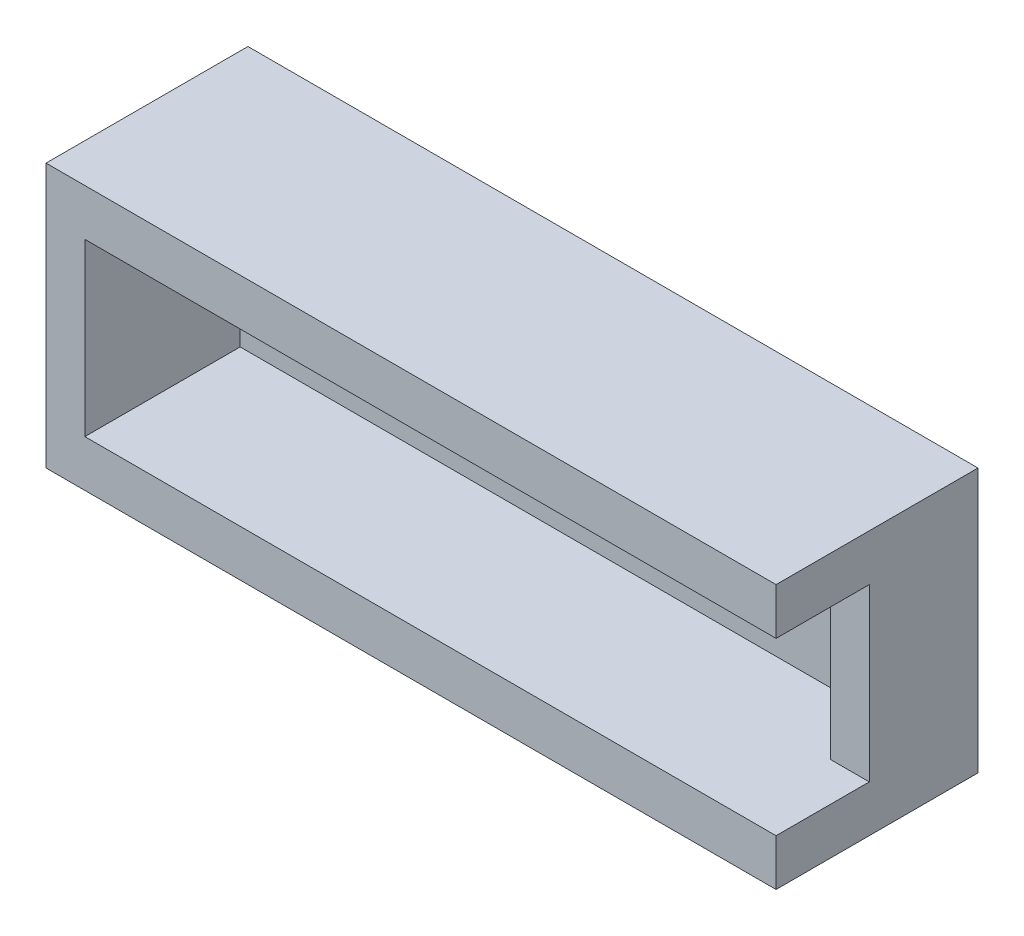
ISO-10303-21;
HEADER;
FILE_DESCRIPTION(('STEP AP214'),'2;1');
FILE_NAME('part.step','',(''),(''),'','','');
FILE_SCHEMA(('AUTOMOTIVE_DESIGN { 1 0 10303 214 1 1 1 1 }'));
ENDSEC;
DATA;
#1=APPLICATION_CONTEXT('core data for automotive mechanical design processes');
#2=APPLICATION_PROTOCOL_DEFINITION('international standard','automotive_design',2000,#1);
#3=PRODUCT_CONTEXT('',#1,'mechanical');
#4=PRODUCT('Part','Part','',(#3));
#5=PRODUCT_RELATED_PRODUCT_CATEGORY('part','',(#4));
#6=PRODUCT_DEFINITION_FORMATION('','',#4);
#7=PRODUCT_DEFINITION_CONTEXT('part definition',#1,'design');
#8=PRODUCT_DEFINITION('design','',#6,#7);
#9=PRODUCT_DEFINITION_SHAPE('','',#8);
#10=(LENGTH_UNIT() NAMED_UNIT(*) SI_UNIT(.MILLI.,.METRE.));
#11=(NAMED_UNIT(*) PLANE_ANGLE_UNIT() SI_UNIT($,.RADIAN.));
#12=(NAMED_UNIT(*) SI_UNIT($,.STERADIAN.) SOLID_ANGLE_UNIT());
#13=UNCERTAINTY_MEASURE_WITH_UNIT(LENGTH_MEASURE(1.E-05),#10,'distance_accuracy_value','');
#14=(GEOMETRIC_REPRESENTATION_CONTEXT(3) GLOBAL_UNCERTAINTY_ASSIGNED_CONTEXT((#13)) GLOBAL_UNIT_ASSIGNED_CONTEXT((#10,
#11,#12)) REPRESENTATION_CONTEXT('',''));
#15=CARTESIAN_POINT('',(0.,0.,0.));
#16=DIRECTION('',(0.,0.,1.));
#17=DIRECTION('',(1.,0.,0.));
#18=AXIS2_PLACEMENT_3D('',#15,#16,#17);
#19=CARTESIAN_POINT('',(0.,0.,10.));
#20=DIRECTION('',(0.,0.,1.));
#21=DIRECTION('',(1.,0.,0.));
#22=AXIS2_PLACEMENT_3D('',#19,#20,#21);
#23=PLANE('',#22);
#24=DIRECTION('',(-1.,0.,0.));
#25=VECTOR('',#24,1.);
#26=CARTESIAN_POINT('',(-12.5064231604569,7.29756097560976,10.));
#27=LINE('',#26,#25);
#28=CARTESIAN_POINT('',(31.9935768395431,7.29756097560976,10.));
#29=VERTEX_POINT('',#28);
#30=CARTESIAN_POINT('',(-12.5064231604569,7.29756097560976,10.));
#31=VERTEX_POINT('',#30);
#32=EDGE_CURVE('E126',#29,#31,#27,.T.);
#33=ORIENTED_EDGE('',*,*,#32,.F.);
#34=DIRECTION('',(0.,1.,0.));
#35=VECTOR('',#34,1.);
#36=CARTESIAN_POINT('',(31.9935768395431,10.2975609756098,10.));
#37=LINE('',#36,#35);
#38=CARTESIAN_POINT('',(31.9935768395431,10.2975609756098,10.));
#39=VERTEX_POINT('',#38);
#40=EDGE_CURVE('E142',#29,#39,#37,.T.);
#41=ORIENTED_EDGE('',*,*,#40,.T.);
#42=DIRECTION('',(-1.,0.,0.));
#43=VECTOR('',#42,1.);
#44=CARTESIAN_POINT('',(-15.0064231604569,10.2975609756098,10.));
#45=LINE('',#44,#43);
#46=CARTESIAN_POINT('',(-15.0064231604569,10.2975609756098,10.));
#47=VERTEX_POINT('',#46);
#48=EDGE_CURVE('E63',#39,#47,#45,.T.);
#49=ORIENTED_EDGE('',*,*,#48,.T.);
#50=DIRECTION('',(0.,-1.,0.));
#51=VECTOR('',#50,1.);
#52=CARTESIAN_POINT('',(-15.0064231604569,10.2975609756098,10.));
#53=LINE('',#52,#51);
#54=CARTESIAN_POINT('',(-15.0064231604569,-6.70243902439024,10.));
#55=VERTEX_POINT('',#54);
#56=EDGE_CURVE('E209',#47,#55,#53,.T.);
#57=ORIENTED_EDGE('',*,*,#56,.T.);
#58=DIRECTION('',(1.,0.,0.));
#59=VECTOR('',#58,1.);
#60=CARTESIAN_POINT('',(-15.0064231604569,-6.70243902439024,10.));
#61=LINE('',#60,#59);
#62=CARTESIAN_POINT('',(31.9935768395431,-6.70243902439024,10.));
#63=VERTEX_POINT('',#62);
#64=EDGE_CURVE('E139',#55,#63,#61,.T.);
#65=ORIENTED_EDGE('',*,*,#64,.T.);
#66=CARTESIAN_POINT('',(31.9935768395431,-3.70243902439024,10.));
#67=VERTEX_POINT('',#66);
#68=EDGE_CURVE('E133',#63,#67,#37,.T.);
#69=ORIENTED_EDGE('',*,*,#68,.T.);
#70=DIRECTION('',(1.,0.,0.));
#71=VECTOR('',#70,1.);
#72=CARTESIAN_POINT('',(-12.5064231604569,-3.70243902439024,10.));
#73=LINE('',#72,#71);
#74=CARTESIAN_POINT('',(-12.5064231604569,-3.70243902439024,10.));
#75=VERTEX_POINT('',#74);
#76=EDGE_CURVE('E116',#75,#67,#73,.T.);
#77=ORIENTED_EDGE('',*,*,#76,.F.);
#78=DIRECTION('',(0.,-1.,0.));
#79=VECTOR('',#78,1.);
#80=CARTESIAN_POINT('',(-12.5064231604569,7.29756097560976,10.));
#81=LINE('',#80,#79);
#82=EDGE_CURVE('E127',#31,#75,#81,.T.);
#83=ORIENTED_EDGE('',*,*,#82,.F.);
#84=EDGE_LOOP('',(#33,#41,#49,#57,#65,#69,#77,#83));
#85=FACE_BOUND('',#84,.T.);
#86=ADVANCED_FACE('F39',(#85),#23,.T.);
#87=CARTESIAN_POINT('',(-15.0064231604569,10.2975609756098,10.));
#88=DIRECTION('',(1.,0.,0.));
#89=DIRECTION('',(0.,0.,-1.));
#90=AXIS2_PLACEMENT_3D('',#87,#88,#89);
#91=PLANE('',#90);
#92=DIRECTION('',(0.,0.,-1.));
#93=VECTOR('',#92,1.);
#94=CARTESIAN_POINT('',(-15.0064231604569,10.2975609756098,10.));
#95=LINE('',#94,#93);
#96=CARTESIAN_POINT('',(-15.0064231604569,10.2975609756098,-3.));
#97=VERTEX_POINT('',#96);
#98=EDGE_CURVE('E146',#47,#97,#95,.T.);
#99=ORIENTED_EDGE('',*,*,#98,.T.);
#100=DIRECTION('',(0.,1.,0.));
#101=VECTOR('',#100,1.);
#102=CARTESIAN_POINT('',(-15.0064231604569,-6.70243902439024,-3.));
#103=LINE('',#102,#101);
#104=CARTESIAN_POINT('',(-15.0064231604569,-6.70243902439024,-3.));
#105=VERTEX_POINT('',#104);
#106=EDGE_CURVE('E214',#105,#97,#103,.T.);
#107=ORIENTED_EDGE('',*,*,#106,.F.);
#108=DIRECTION('',(0.,0.,-1.));
#109=VECTOR('',#108,1.);
#110=CARTESIAN_POINT('',(-15.0064231604569,-6.70243902439024,10.));
#111=LINE('',#110,#109);
#112=EDGE_CURVE('E11',#55,#105,#111,.T.);
#113=ORIENTED_EDGE('',*,*,#112,.F.);
#114=ORIENTED_EDGE('',*,*,#56,.F.);
#115=EDGE_LOOP('',(#99,#107,#113,#114));
#116=FACE_BOUND('',#115,.T.);
#117=ADVANCED_FACE('F41',(#116),#91,.F.);
#118=CARTESIAN_POINT('',(-15.0064231604569,-6.70243902439024,10.));
#119=DIRECTION('',(0.,1.,0.));
#120=DIRECTION('',(0.,0.,1.));
#121=AXIS2_PLACEMENT_3D('',#118,#119,#120);
#122=PLANE('',#121);
#123=ORIENTED_EDGE('',*,*,#112,.T.);
#124=DIRECTION('',(-1.,0.,0.));
#125=VECTOR('',#124,1.);
#126=CARTESIAN_POINT('',(-15.0064231604569,-6.70243902439024,-3.));
#127=LINE('',#126,#125);
#128=CARTESIAN_POINT('',(31.9935768395431,-6.70243902439024,-3.));
#129=VERTEX_POINT('',#128);
#130=EDGE_CURVE('E167',#129,#105,#127,.T.);
#131=ORIENTED_EDGE('',*,*,#130,.F.);
#132=DIRECTION('',(0.,0.,-1.));
#133=VECTOR('',#132,1.);
#134=CARTESIAN_POINT('',(31.9935768395431,-6.70243902439024,10.));
#135=LINE('',#134,#133);
#136=EDGE_CURVE('E48',#63,#129,#135,.T.);
#137=ORIENTED_EDGE('',*,*,#136,.F.);
#138=ORIENTED_EDGE('',*,*,#64,.F.);
#139=EDGE_LOOP('',(#123,#131,#137,#138));
#140=FACE_BOUND('',#139,.T.);
#141=ADVANCED_FACE('F173',(#140),#122,.F.);
#142=CARTESIAN_POINT('',(31.9935768395431,10.2975609756098,10.));
#143=DIRECTION('',(-1.,0.,0.));
#144=DIRECTION('',(0.,0.,1.));
#145=AXIS2_PLACEMENT_3D('',#142,#143,#144);
#146=PLANE('',#145);
#147=ORIENTED_EDGE('',*,*,#40,.F.);
#148=DIRECTION('',(0.,0.,1.));
#149=VECTOR('',#148,1.);
#150=CARTESIAN_POINT('',(31.9935768395431,7.29756097560976,10.));
#151=LINE('',#150,#149);
#152=CARTESIAN_POINT('',(31.9935768395431,7.29756097560976,4.));
#153=VERTEX_POINT('',#152);
#154=EDGE_CURVE('E225',#153,#29,#151,.T.);
#155=ORIENTED_EDGE('',*,*,#154,.F.);
#156=DIRECTION('',(0.,1.,0.));
#157=VECTOR('',#156,1.);
#158=CARTESIAN_POINT('',(31.9935768395431,-3.70243902439024,4.));
#159=LINE('',#158,#157);
#160=CARTESIAN_POINT('',(31.9935768395431,-3.70243902439024,4.));
#161=VERTEX_POINT('',#160);
#162=EDGE_CURVE('E136',#161,#153,#159,.T.);
#163=ORIENTED_EDGE('',*,*,#162,.F.);
#164=DIRECTION('',(0.,0.,-1.));
#165=VECTOR('',#164,1.);
#166=CARTESIAN_POINT('',(31.9935768395431,-3.70243902439024,10.));
#167=LINE('',#166,#165);
#168=EDGE_CURVE('E119',#67,#161,#167,.T.);
#169=ORIENTED_EDGE('',*,*,#168,.F.);
#170=ORIENTED_EDGE('',*,*,#68,.F.);
#171=ORIENTED_EDGE('',*,*,#136,.T.);
#172=DIRECTION('',(0.,-1.,0.));
#173=VECTOR('',#172,1.);
#174=CARTESIAN_POINT('',(31.9935768395431,-6.70243902439024,-3.));
#175=LINE('',#174,#173);
#176=CARTESIAN_POINT('',(31.9935768395431,10.2975609756098,-3.));
#177=VERTEX_POINT('',#176);
#178=EDGE_CURVE('E159',#177,#129,#175,.T.);
#179=ORIENTED_EDGE('',*,*,#178,.F.);
#180=DIRECTION('',(0.,0.,-1.));
#181=VECTOR('',#180,1.);
#182=CARTESIAN_POINT('',(31.9935768395431,10.2975609756098,10.));
#183=LINE('',#182,#181);
#184=EDGE_CURVE('E153',#39,#177,#183,.T.);
#185=ORIENTED_EDGE('',*,*,#184,.F.);
#186=EDGE_LOOP('',(#147,#155,#163,#169,#170,#171,#179,#185));
#187=FACE_BOUND('',#186,.T.);
#188=ADVANCED_FACE('F132',(#187),#146,.F.);
#189=CARTESIAN_POINT('',(-15.0064231604569,10.2975609756098,10.));
#190=DIRECTION('',(0.,-1.,0.));
#191=DIRECTION('',(1.,0.,0.));
#192=AXIS2_PLACEMENT_3D('',#189,#190,#191);
#193=PLANE('',#192);
#194=ORIENTED_EDGE('',*,*,#184,.T.);
#195=DIRECTION('',(1.,0.,0.));
#196=VECTOR('',#195,1.);
#197=CARTESIAN_POINT('',(-15.0064231604569,10.2975609756098,-3.));
#198=LINE('',#197,#196);
#199=EDGE_CURVE('E170',#97,#177,#198,.T.);
#200=ORIENTED_EDGE('',*,*,#199,.F.);
#201=ORIENTED_EDGE('',*,*,#98,.F.);
#202=ORIENTED_EDGE('',*,*,#48,.F.);
#203=EDGE_LOOP('',(#194,#200,#201,#202));
#204=FACE_BOUND('',#203,.T.);
#205=ADVANCED_FACE('F265',(#204),#193,.F.);
#206=CARTESIAN_POINT('',(-12.5064231604569,7.29756097560976,10.));
#207=DIRECTION('',(1.,0.,0.));
#208=DIRECTION('',(0.,1.,0.));
#209=AXIS2_PLACEMENT_3D('',#206,#207,#208);
#210=PLANE('',#209);
#211=DIRECTION('',(0.,-1.,0.));
#212=VECTOR('',#211,1.);
#213=CARTESIAN_POINT('',(-12.5064231604569,7.29756097560976,0.));
#214=LINE('',#213,#212);
#215=CARTESIAN_POINT('',(-12.5064231604569,7.29756097560976,0.));
#216=VERTEX_POINT('',#215);
#217=CARTESIAN_POINT('',(-12.5064231604569,-3.70243902439024,0.));
#218=VERTEX_POINT('',#217);
#219=EDGE_CURVE('E176',#216,#218,#214,.T.);
#220=ORIENTED_EDGE('',*,*,#219,.F.);
#221=DIRECTION('',(0.,0.,-1.));
#222=VECTOR('',#221,1.);
#223=CARTESIAN_POINT('',(-12.5064231604569,7.29756097560976,10.));
#224=LINE('',#223,#222);
#225=EDGE_CURVE('E188',#31,#216,#224,.T.);
#226=ORIENTED_EDGE('',*,*,#225,.F.);
#227=ORIENTED_EDGE('',*,*,#82,.T.);
#228=DIRECTION('',(0.,0.,-1.));
#229=VECTOR('',#228,1.);
#230=CARTESIAN_POINT('',(-12.5064231604569,-3.70243902439024,10.));
#231=LINE('',#230,#229);
#232=EDGE_CURVE('E122',#75,#218,#231,.T.);
#233=ORIENTED_EDGE('',*,*,#232,.T.);
#234=EDGE_LOOP('',(#220,#226,#227,#233));
#235=FACE_BOUND('',#234,.T.);
#236=ADVANCED_FACE('F247',(#235),#210,.T.);
#237=CARTESIAN_POINT('',(-12.5064231604569,-3.70243902439024,10.));
#238=DIRECTION('',(0.,1.,0.));
#239=DIRECTION('',(0.,0.,1.));
#240=AXIS2_PLACEMENT_3D('',#237,#238,#239);
#241=PLANE('',#240);
#242=DIRECTION('',(1.,0.,0.));
#243=VECTOR('',#242,1.);
#244=CARTESIAN_POINT('',(28.9935768395431,-3.70243902439024,4.));
#245=LINE('',#244,#243);
#246=CARTESIAN_POINT('',(29.4935768395431,-3.70243902439024,4.));
#247=VERTEX_POINT('',#246);
#248=EDGE_CURVE('E55',#247,#161,#245,.T.);
#249=ORIENTED_EDGE('',*,*,#248,.F.);
#250=DIRECTION('',(0.,0.,-1.));
#251=VECTOR('',#250,1.);
#252=CARTESIAN_POINT('',(29.4935768395431,-3.70243902439024,10.));
#253=LINE('',#252,#251);
#254=CARTESIAN_POINT('',(29.4935768395431,-3.70243902439024,0.));
#255=VERTEX_POINT('',#254);
#256=EDGE_CURVE('E205',#247,#255,#253,.T.);
#257=ORIENTED_EDGE('',*,*,#256,.T.);
#258=DIRECTION('',(1.,0.,0.));
#259=VECTOR('',#258,1.);
#260=CARTESIAN_POINT('',(-12.5064231604569,-3.70243902439024,0.));
#261=LINE('',#260,#259);
#262=EDGE_CURVE('E180',#218,#255,#261,.T.);
#263=ORIENTED_EDGE('',*,*,#262,.F.);
#264=ORIENTED_EDGE('',*,*,#232,.F.);
#265=ORIENTED_EDGE('',*,*,#76,.T.);
#266=ORIENTED_EDGE('',*,*,#168,.T.);
#267=EDGE_LOOP('',(#249,#257,#263,#264,#265,#266));
#268=FACE_BOUND('',#267,.T.);
#269=ADVANCED_FACE('F118',(#268),#241,.T.);
#270=CARTESIAN_POINT('',(29.4935768395431,7.29756097560976,10.));
#271=DIRECTION('',(-1.,0.,0.));
#272=DIRECTION('',(0.,-1.,0.));
#273=AXIS2_PLACEMENT_3D('',#270,#271,#272);
#274=PLANE('',#273);
#275=DIRECTION('',(0.,-1.,0.));
#276=VECTOR('',#275,1.);
#277=CARTESIAN_POINT('',(29.4935768395431,7.29756097560976,4.));
#278=LINE('',#277,#276);
#279=CARTESIAN_POINT('',(29.4935768395431,7.29756097560976,4.));
#280=VERTEX_POINT('',#279);
#281=EDGE_CURVE('E216',#280,#247,#278,.T.);
#282=ORIENTED_EDGE('',*,*,#281,.F.);
#283=DIRECTION('',(0.,0.,-1.));
#284=VECTOR('',#283,1.);
#285=CARTESIAN_POINT('',(29.4935768395431,7.29756097560976,10.));
#286=LINE('',#285,#284);
#287=CARTESIAN_POINT('',(29.4935768395431,7.29756097560976,0.));
#288=VERTEX_POINT('',#287);
#289=EDGE_CURVE('E202',#280,#288,#286,.T.);
#290=ORIENTED_EDGE('',*,*,#289,.T.);
#291=DIRECTION('',(0.,1.,0.));
#292=VECTOR('',#291,1.);
#293=CARTESIAN_POINT('',(29.4935768395431,7.29756097560976,0.));
#294=LINE('',#293,#292);
#295=EDGE_CURVE('E193',#255,#288,#294,.T.);
#296=ORIENTED_EDGE('',*,*,#295,.F.);
#297=ORIENTED_EDGE('',*,*,#256,.F.);
#298=EDGE_LOOP('',(#282,#290,#296,#297));
#299=FACE_BOUND('',#298,.T.);
#300=ADVANCED_FACE('F242',(#299),#274,.T.);
#301=CARTESIAN_POINT('',(-12.5064231604569,7.29756097560976,10.));
#302=DIRECTION('',(0.,-1.,0.));
#303=DIRECTION('',(0.,0.,-1.));
#304=AXIS2_PLACEMENT_3D('',#301,#302,#303);
#305=PLANE('',#304);
#306=ORIENTED_EDGE('',*,*,#289,.F.);
#307=DIRECTION('',(1.,0.,0.));
#308=VECTOR('',#307,1.);
#309=CARTESIAN_POINT('',(28.9935768395431,7.29756097560976,4.));
#310=LINE('',#309,#308);
#311=EDGE_CURVE('E220',#280,#153,#310,.T.);
#312=ORIENTED_EDGE('',*,*,#311,.T.);
#313=ORIENTED_EDGE('',*,*,#154,.T.);
#314=ORIENTED_EDGE('',*,*,#32,.T.);
#315=ORIENTED_EDGE('',*,*,#225,.T.);
#316=DIRECTION('',(-1.,0.,0.));
#317=VECTOR('',#316,1.);
#318=CARTESIAN_POINT('',(-12.5064231604569,7.29756097560976,0.));
#319=LINE('',#318,#317);
#320=EDGE_CURVE('E185',#288,#216,#319,.T.);
#321=ORIENTED_EDGE('',*,*,#320,.F.);
#322=EDGE_LOOP('',(#306,#312,#313,#314,#315,#321));
#323=FACE_BOUND('',#322,.T.);
#324=ADVANCED_FACE('F237',(#323),#305,.T.);
#325=CARTESIAN_POINT('',(0.,0.,0.));
#326=DIRECTION('',(0.,0.,-1.));
#327=DIRECTION('',(-1.,0.,0.));
#328=AXIS2_PLACEMENT_3D('',#325,#326,#327);
#329=PLANE('',#328);
#330=ORIENTED_EDGE('',*,*,#320,.T.);
#331=ORIENTED_EDGE('',*,*,#219,.T.);
#332=ORIENTED_EDGE('',*,*,#262,.T.);
#333=ORIENTED_EDGE('',*,*,#295,.T.);
#334=EDGE_LOOP('',(#330,#331,#332,#333));
#335=FACE_BOUND('',#334,.T.);
#336=ADVANCED_FACE('F248',(#335),#329,.F.);
#337=CARTESIAN_POINT('',(0.,0.,-3.));
#338=DIRECTION('',(0.,0.,-1.));
#339=DIRECTION('',(-1.,0.,0.));
#340=AXIS2_PLACEMENT_3D('',#337,#338,#339);
#341=PLANE('',#340);
#342=ORIENTED_EDGE('',*,*,#106,.T.);
#343=ORIENTED_EDGE('',*,*,#199,.T.);
#344=ORIENTED_EDGE('',*,*,#178,.T.);
#345=ORIENTED_EDGE('',*,*,#130,.T.);
#346=EDGE_LOOP('',(#342,#343,#344,#345));
#347=FACE_BOUND('',#346,.T.);
#348=ADVANCED_FACE('F166',(#347),#341,.T.);
#349=CARTESIAN_POINT('',(28.9935768395431,-3.70243902439024,4.));
#350=DIRECTION('',(0.,0.,-1.));
#351=DIRECTION('',(-1.,0.,0.));
#352=AXIS2_PLACEMENT_3D('',#349,#350,#351);
#353=PLANE('',#352);
#354=ORIENTED_EDGE('',*,*,#281,.T.);
#355=ORIENTED_EDGE('',*,*,#248,.T.);
#356=ORIENTED_EDGE('',*,*,#162,.T.);
#357=ORIENTED_EDGE('',*,*,#311,.F.);
#358=EDGE_LOOP('',(#354,#355,#356,#357));
#359=FACE_BOUND('',#358,.T.);
#360=ADVANCED_FACE('F233',(#359),#353,.F.);
#361=CLOSED_SHELL('',(#86,#117,#141,#188,#205,#236,#269,#300,#324,#336,#348,#360));
#362=MANIFOLD_SOLID_BREP('B2',#361);
#363=ADVANCED_BREP_SHAPE_REPRESENTATION('',(#18,#362),#14);
#364=SHAPE_DEFINITION_REPRESENTATION(#9,#363);
ENDSEC;
END-ISO-10303-21;
